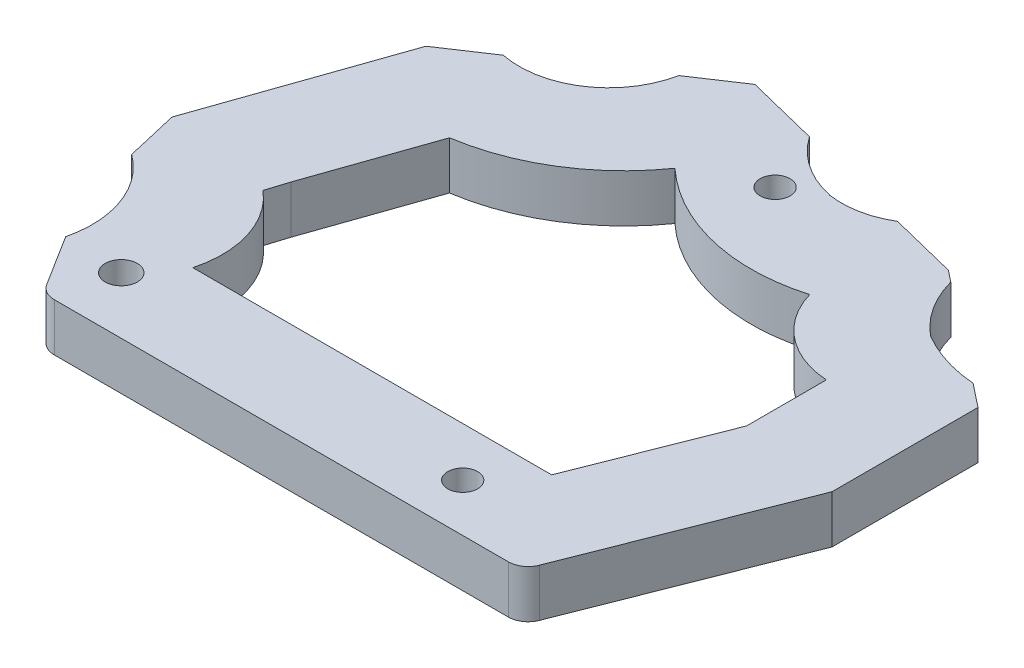
ISO-10303-21;
HEADER;
FILE_DESCRIPTION(('STEP AP214'),'2;1');
FILE_NAME('part.step','',(''),(''),'','','');
FILE_SCHEMA(('AUTOMOTIVE_DESIGN { 1 0 10303 214 1 1 1 1 }'));
ENDSEC;
DATA;
#1=APPLICATION_CONTEXT('core data for automotive mechanical design processes');
#2=APPLICATION_PROTOCOL_DEFINITION('international standard','automotive_design',2000,#1);
#3=PRODUCT_CONTEXT('',#1,'mechanical');
#4=PRODUCT('Part','Part','',(#3));
#5=PRODUCT_RELATED_PRODUCT_CATEGORY('part','',(#4));
#6=PRODUCT_DEFINITION_FORMATION('','',#4);
#7=PRODUCT_DEFINITION_CONTEXT('part definition',#1,'design');
#8=PRODUCT_DEFINITION('design','',#6,#7);
#9=PRODUCT_DEFINITION_SHAPE('','',#8);
#10=(LENGTH_UNIT() NAMED_UNIT(*) SI_UNIT(.MILLI.,.METRE.));
#11=(NAMED_UNIT(*) PLANE_ANGLE_UNIT() SI_UNIT($,.RADIAN.));
#12=(NAMED_UNIT(*) SI_UNIT($,.STERADIAN.) SOLID_ANGLE_UNIT());
#13=UNCERTAINTY_MEASURE_WITH_UNIT(LENGTH_MEASURE(1.E-05),#10,'distance_accuracy_value','');
#14=(GEOMETRIC_REPRESENTATION_CONTEXT(3) GLOBAL_UNCERTAINTY_ASSIGNED_CONTEXT((#13)) GLOBAL_UNIT_ASSIGNED_CONTEXT((#10,
#11,#12)) REPRESENTATION_CONTEXT('',''));
#15=CARTESIAN_POINT('',(0.,0.,0.));
#16=DIRECTION('',(0.,0.,1.));
#17=DIRECTION('',(1.,0.,0.));
#18=AXIS2_PLACEMENT_3D('',#15,#16,#17);
#19=CARTESIAN_POINT('',(41.5628843685812,4.8,16.3568056984194));
#20=DIRECTION('',(0.930533945831876,0.,0.366205646672138));
#21=DIRECTION('',(0.366205646672138,0.,-0.930533945831876));
#22=AXIS2_PLACEMENT_3D('',#19,#20,#21);
#23=PLANE('',#22);
#24=DIRECTION('',(-0.366205646672138,0.,0.930533945831876));
#25=VECTOR('',#24,1.);
#26=CARTESIAN_POINT('',(41.5628843685812,4.8,16.3568056984194));
#27=LINE('',#26,#25);
#28=CARTESIAN_POINT('',(56.7889355201313,4.8,-22.332814699965));
#29=VERTEX_POINT('',#28);
#30=CARTESIAN_POINT('',(48.4988513789469,4.8,-1.26758870665573));
#31=VERTEX_POINT('',#30);
#32=EDGE_CURVE('E301',#29,#31,#27,.T.);
#33=ORIENTED_EDGE('',*,*,#32,.T.);
#34=DIRECTION('',(0.,-1.,0.));
#35=VECTOR('',#34,1.);
#36=CARTESIAN_POINT('',(48.4988513789469,0.,-1.26758870665573));
#37=LINE('',#36,#35);
#38=CARTESIAN_POINT('',(48.4988513789469,0.,-1.26758870665573));
#39=VERTEX_POINT('',#38);
#40=EDGE_CURVE('E11',#31,#39,#37,.T.);
#41=ORIENTED_EDGE('',*,*,#40,.T.);
#42=DIRECTION('',(-0.366205646672138,0.,0.930533945831876));
#43=VECTOR('',#42,1.);
#44=CARTESIAN_POINT('',(41.5628843685812,0.,16.3568056984194));
#45=LINE('',#44,#43);
#46=CARTESIAN_POINT('',(56.7889355201313,0.,-22.332814699965));
#47=VERTEX_POINT('',#46);
#48=EDGE_CURVE('E400',#47,#39,#45,.T.);
#49=ORIENTED_EDGE('',*,*,#48,.F.);
#50=DIRECTION('',(0.,-1.,0.));
#51=VECTOR('',#50,1.);
#52=CARTESIAN_POINT('',(56.7889355201313,4.8,-22.332814699965));
#53=LINE('',#52,#51);
#54=EDGE_CURVE('E511',#29,#47,#53,.T.);
#55=ORIENTED_EDGE('',*,*,#54,.F.);
#56=EDGE_LOOP('',(#33,#41,#49,#55));
#57=FACE_BOUND('',#56,.T.);
#58=ADVANCED_FACE('F45',(#57),#23,.T.);
#59=CARTESIAN_POINT('',(56.7889355201313,4.8,0.));
#60=DIRECTION('',(1.,0.,0.));
#61=DIRECTION('',(0.,0.,-1.));
#62=AXIS2_PLACEMENT_3D('',#59,#60,#61);
#63=PLANE('',#62);
#64=DIRECTION('',(0.,0.,1.));
#65=VECTOR('',#64,1.);
#66=CARTESIAN_POINT('',(56.7889355201313,0.,0.));
#67=LINE('',#66,#65);
#68=CARTESIAN_POINT('',(56.7889355201313,0.,-36.95968206653));
#69=VERTEX_POINT('',#68);
#70=EDGE_CURVE('E404',#69,#47,#67,.T.);
#71=ORIENTED_EDGE('',*,*,#70,.F.);
#72=DIRECTION('',(0.,-1.,0.));
#73=VECTOR('',#72,1.);
#74=CARTESIAN_POINT('',(56.7889355201313,4.8,-36.95968206653));
#75=LINE('',#74,#73);
#76=CARTESIAN_POINT('',(56.7889355201313,4.8,-36.95968206653));
#77=VERTEX_POINT('',#76);
#78=EDGE_CURVE('E508',#77,#69,#75,.T.);
#79=ORIENTED_EDGE('',*,*,#78,.F.);
#80=DIRECTION('',(0.,0.,1.));
#81=VECTOR('',#80,1.);
#82=CARTESIAN_POINT('',(56.7889355201313,4.8,0.));
#83=LINE('',#82,#81);
#84=EDGE_CURVE('E304',#77,#29,#83,.T.);
#85=ORIENTED_EDGE('',*,*,#84,.T.);
#86=ORIENTED_EDGE('',*,*,#54,.T.);
#87=EDGE_LOOP('',(#71,#79,#85,#86));
#88=FACE_BOUND('',#87,.T.);
#89=ADVANCED_FACE('F586',(#88),#63,.T.);
#90=CARTESIAN_POINT('',(39.7983361955812,4.8,-50.3812847105911));
#91=DIRECTION('',(-0.619871067373993,0.,0.784703676449032));
#92=DIRECTION('',(0.784703676449032,0.,0.619871067373993));
#93=AXIS2_PLACEMENT_3D('',#90,#91,#92);
#94=PLANE('',#93);
#95=DIRECTION('',(-0.784703676449032,0.,-0.619871067373993));
#96=VECTOR('',#95,1.);
#97=CARTESIAN_POINT('',(39.7983361955812,0.,-50.3812847105911));
#98=LINE('',#97,#96);
#99=CARTESIAN_POINT('',(54.4348244907842,0.,-38.819295268652));
#100=VERTEX_POINT('',#99);
#101=EDGE_CURVE('E408',#69,#100,#98,.T.);
#102=ORIENTED_EDGE('',*,*,#101,.T.);
#103=DIRECTION('',(0.,-1.,0.));
#104=VECTOR('',#103,1.);
#105=CARTESIAN_POINT('',(54.4348244907842,4.8,-38.819295268652));
#106=LINE('',#105,#104);
#107=CARTESIAN_POINT('',(54.4348244907842,4.8,-38.819295268652));
#108=VERTEX_POINT('',#107);
#109=EDGE_CURVE('E505',#108,#100,#106,.T.);
#110=ORIENTED_EDGE('',*,*,#109,.F.);
#111=DIRECTION('',(-0.784703676449032,0.,-0.619871067373993));
#112=VECTOR('',#111,1.);
#113=CARTESIAN_POINT('',(39.7983361955812,4.8,-50.3812847105911));
#114=LINE('',#113,#112);
#115=EDGE_CURVE('E308',#77,#108,#114,.T.);
#116=ORIENTED_EDGE('',*,*,#115,.F.);
#117=ORIENTED_EDGE('',*,*,#78,.T.);
#118=EDGE_LOOP('',(#102,#110,#116,#117));
#119=FACE_BOUND('',#118,.T.);
#120=ADVANCED_FACE('F592',(#119),#94,.F.);
#121=CARTESIAN_POINT('',(55.5185057154235,4.8,-53.1336012109435));
#122=DIRECTION('',(0.,-1.,0.));
#123=DIRECTION('',(0.,0.,-1.));
#124=AXIS2_PLACEMENT_3D('',#121,#122,#123);
#125=CYLINDRICAL_SURFACE('',#124,14.3552680088585);
#126=CARTESIAN_POINT('',(55.5185057154235,0.,-53.1336012109435));
#127=DIRECTION('',(0.,1.,0.));
#128=DIRECTION('',(0.,0.,1.));
#129=AXIS2_PLACEMENT_3D('',#126,#127,#128);
#130=CIRCLE('',#129,14.3552680088585);
#131=CARTESIAN_POINT('',(48.2152560640326,0.,-40.7749498227209));
#132=VERTEX_POINT('',#131);
#133=EDGE_CURVE('E412',#132,#100,#130,.T.);
#134=ORIENTED_EDGE('',*,*,#133,.F.);
#135=DIRECTION('',(0.,-1.,0.));
#136=VECTOR('',#135,1.);
#137=CARTESIAN_POINT('',(48.2152560640326,4.8,-40.7749498227209));
#138=LINE('',#137,#136);
#139=CARTESIAN_POINT('',(48.2152560640326,4.8,-40.7749498227209));
#140=VERTEX_POINT('',#139);
#141=EDGE_CURVE('E502',#140,#132,#138,.T.);
#142=ORIENTED_EDGE('',*,*,#141,.F.);
#143=CARTESIAN_POINT('',(55.5185057154235,4.8,-53.1336012109435));
#144=DIRECTION('',(0.,1.,0.));
#145=DIRECTION('',(0.,0.,1.));
#146=AXIS2_PLACEMENT_3D('',#143,#144,#145);
#147=CIRCLE('',#146,14.3552680088585);
#148=EDGE_CURVE('E311',#140,#108,#147,.T.);
#149=ORIENTED_EDGE('',*,*,#148,.T.);
#150=ORIENTED_EDGE('',*,*,#109,.T.);
#151=EDGE_LOOP('',(#134,#142,#149,#150));
#152=FACE_BOUND('',#151,.T.);
#153=ADVANCED_FACE('F658',(#152),#125,.F.);
#154=CARTESIAN_POINT('',(55.2721485776059,4.8,-49.3668085057952));
#155=DIRECTION('',(0.,-1.,0.));
#156=DIRECTION('',(0.,0.,-1.));
#157=AXIS2_PLACEMENT_3D('',#154,#155,#156);
#158=CYLINDRICAL_SURFACE('',#157,11.1184426777335);
#159=CARTESIAN_POINT('',(55.2721485776059,0.,-49.3668085057952));
#160=DIRECTION('',(0.,1.,0.));
#161=DIRECTION('',(0.,0.,1.));
#162=AXIS2_PLACEMENT_3D('',#159,#160,#161);
#163=CIRCLE('',#162,11.1184426777335);
#164=CARTESIAN_POINT('',(44.5341657542064,0.,-46.4831489450247));
#165=VERTEX_POINT('',#164);
#166=EDGE_CURVE('E416',#165,#132,#163,.T.);
#167=ORIENTED_EDGE('',*,*,#166,.F.);
#168=DIRECTION('',(0.,-1.,0.));
#169=VECTOR('',#168,1.);
#170=CARTESIAN_POINT('',(44.5341657542064,4.8,-46.4831489450247));
#171=LINE('',#170,#169);
#172=CARTESIAN_POINT('',(44.5341657542064,4.8,-46.4831489450247));
#173=VERTEX_POINT('',#172);
#174=EDGE_CURVE('E499',#173,#165,#171,.T.);
#175=ORIENTED_EDGE('',*,*,#174,.F.);
#176=CARTESIAN_POINT('',(55.2721485776059,4.8,-49.3668085057952));
#177=DIRECTION('',(0.,1.,0.));
#178=DIRECTION('',(0.,0.,1.));
#179=AXIS2_PLACEMENT_3D('',#176,#177,#178);
#180=CIRCLE('',#179,11.1184426777335);
#181=EDGE_CURVE('E315',#173,#140,#180,.T.);
#182=ORIENTED_EDGE('',*,*,#181,.T.);
#183=ORIENTED_EDGE('',*,*,#141,.T.);
#184=EDGE_LOOP('',(#167,#175,#182,#183));
#185=FACE_BOUND('',#184,.T.);
#186=ADVANCED_FACE('F661',(#185),#158,.F.);
#187=CARTESIAN_POINT('',(39.8895295681035,4.8,-50.175626088264));
#188=DIRECTION('',(0.622304732207846,0.,-0.782775076424716));
#189=DIRECTION('',(-0.782775076424716,0.,-0.622304732207846));
#190=AXIS2_PLACEMENT_3D('',#187,#188,#189);
#191=PLANE('',#190);
#192=DIRECTION('',(0.782775076424716,0.,0.622304732207846));
#193=VECTOR('',#192,1.);
#194=CARTESIAN_POINT('',(39.8895295681035,0.,-50.175626088264));
#195=LINE('',#194,#193);
#196=CARTESIAN_POINT('',(43.3865769077676,0.,-47.3954799469642));
#197=VERTEX_POINT('',#196);
#198=EDGE_CURVE('E420',#197,#165,#195,.T.);
#199=ORIENTED_EDGE('',*,*,#198,.F.);
#200=DIRECTION('',(0.,-1.,0.));
#201=VECTOR('',#200,1.);
#202=CARTESIAN_POINT('',(43.3865769077676,4.8,-47.3954799469642));
#203=LINE('',#202,#201);
#204=CARTESIAN_POINT('',(43.3865769077676,4.8,-47.3954799469642));
#205=VERTEX_POINT('',#204);
#206=EDGE_CURVE('E496',#205,#197,#203,.T.);
#207=ORIENTED_EDGE('',*,*,#206,.F.);
#208=DIRECTION('',(0.782775076424716,0.,0.622304732207846));
#209=VECTOR('',#208,1.);
#210=CARTESIAN_POINT('',(39.8895295681035,4.8,-50.175626088264));
#211=LINE('',#210,#209);
#212=EDGE_CURVE('E319',#205,#173,#211,.T.);
#213=ORIENTED_EDGE('',*,*,#212,.T.);
#214=ORIENTED_EDGE('',*,*,#174,.T.);
#215=EDGE_LOOP('',(#199,#207,#213,#214));
#216=FACE_BOUND('',#215,.T.);
#217=ADVANCED_FACE('F666',(#216),#191,.T.);
#218=CARTESIAN_POINT('',(13.6469879297286,4.8,-54.8014164711111));
#219=DIRECTION('',(0.241646157516865,0.,-0.970364433889317));
#220=DIRECTION('',(-0.970364433889317,0.,-0.241646157516865));
#221=AXIS2_PLACEMENT_3D('',#218,#219,#220);
#222=PLANE('',#221);
#223=DIRECTION('',(0.970364433889317,0.,0.241646157516865));
#224=VECTOR('',#223,1.);
#225=CARTESIAN_POINT('',(13.6469879297286,0.,-54.8014164711111));
#226=LINE('',#225,#224);
#227=CARTESIAN_POINT('',(36.5940258705424,0.,-49.0870030495823));
#228=VERTEX_POINT('',#227);
#229=EDGE_CURVE('E424',#228,#197,#226,.T.);
#230=ORIENTED_EDGE('',*,*,#229,.F.);
#231=DIRECTION('',(0.,-1.,0.));
#232=VECTOR('',#231,1.);
#233=CARTESIAN_POINT('',(36.5940258705424,4.8,-49.0870030495823));
#234=LINE('',#233,#232);
#235=CARTESIAN_POINT('',(36.5940258705424,4.8,-49.0870030495823));
#236=VERTEX_POINT('',#235);
#237=EDGE_CURVE('E493',#236,#228,#234,.T.);
#238=ORIENTED_EDGE('',*,*,#237,.F.);
#239=DIRECTION('',(0.970364433889317,0.,0.241646157516865));
#240=VECTOR('',#239,1.);
#241=CARTESIAN_POINT('',(13.6469879297286,4.8,-54.8014164711111));
#242=LINE('',#241,#240);
#243=EDGE_CURVE('E323',#236,#205,#242,.T.);
#244=ORIENTED_EDGE('',*,*,#243,.T.);
#245=ORIENTED_EDGE('',*,*,#206,.T.);
#246=EDGE_LOOP('',(#230,#238,#244,#245));
#247=FACE_BOUND('',#246,.T.);
#248=ADVANCED_FACE('F669',(#247),#222,.T.);
#249=CARTESIAN_POINT('',(32.1763201205619,4.8,-56.4390751610626));
#250=DIRECTION('',(0.,-1.,0.));
#251=DIRECTION('',(0.,0.,-1.));
#252=AXIS2_PLACEMENT_3D('',#249,#250,#251);
#253=CYLINDRICAL_SURFACE('',#252,8.57724247213625);
#254=CARTESIAN_POINT('',(32.1763201205619,0.,-56.4390751610626));
#255=DIRECTION('',(0.,1.,0.));
#256=DIRECTION('',(0.,0.,1.));
#257=AXIS2_PLACEMENT_3D('',#254,#255,#256);
#258=CIRCLE('',#257,8.57724247213625);
#259=CARTESIAN_POINT('',(30.9370593029061,0.,-47.9518305521426));
#260=VERTEX_POINT('',#259);
#261=EDGE_CURVE('E428',#260,#228,#258,.T.);
#262=ORIENTED_EDGE('',*,*,#261,.F.);
#263=DIRECTION('',(0.,-1.,0.));
#264=VECTOR('',#263,1.);
#265=CARTESIAN_POINT('',(30.9370593029061,4.8,-47.9518305521426));
#266=LINE('',#265,#264);
#267=CARTESIAN_POINT('',(30.9370593029061,4.8,-47.9518305521426));
#268=VERTEX_POINT('',#267);
#269=EDGE_CURVE('E490',#268,#260,#266,.T.);
#270=ORIENTED_EDGE('',*,*,#269,.F.);
#271=CARTESIAN_POINT('',(32.1763201205619,4.8,-56.4390751610626));
#272=DIRECTION('',(0.,1.,0.));
#273=DIRECTION('',(0.,0.,1.));
#274=AXIS2_PLACEMENT_3D('',#271,#272,#273);
#275=CIRCLE('',#274,8.57724247213625);
#276=EDGE_CURVE('E327',#268,#236,#275,.T.);
#277=ORIENTED_EDGE('',*,*,#276,.T.);
#278=ORIENTED_EDGE('',*,*,#237,.T.);
#279=EDGE_LOOP('',(#262,#270,#277,#278));
#280=FACE_BOUND('',#279,.T.);
#281=ADVANCED_FACE('F674',(#280),#253,.F.);
#282=CARTESIAN_POINT('',(33.0360339215245,4.8,-57.7304421719374));
#283=DIRECTION('',(0.,-1.,0.));
#284=DIRECTION('',(0.,0.,-1.));
#285=AXIS2_PLACEMENT_3D('',#282,#283,#284);
#286=CYLINDRICAL_SURFACE('',#285,10.0013468923135);
#287=CARTESIAN_POINT('',(33.0360339215245,0.,-57.7304421719374));
#288=DIRECTION('',(0.,1.,0.));
#289=DIRECTION('',(0.,0.,1.));
#290=AXIS2_PLACEMENT_3D('',#287,#288,#289);
#291=CIRCLE('',#290,10.0013468923135);
#292=CARTESIAN_POINT('',(24.8242480090241,0.,-52.0213694111776));
#293=VERTEX_POINT('',#292);
#294=EDGE_CURVE('E432',#293,#260,#291,.T.);
#295=ORIENTED_EDGE('',*,*,#294,.F.);
#296=DIRECTION('',(0.,-1.,0.));
#297=VECTOR('',#296,1.);
#298=CARTESIAN_POINT('',(24.8242480090241,4.8,-52.0213694111776));
#299=LINE('',#298,#297);
#300=CARTESIAN_POINT('',(24.8242480090241,4.8,-52.0213694111776));
#301=VERTEX_POINT('',#300);
#302=EDGE_CURVE('E487',#301,#293,#299,.T.);
#303=ORIENTED_EDGE('',*,*,#302,.F.);
#304=CARTESIAN_POINT('',(33.0360339215245,4.8,-57.7304421719374));
#305=DIRECTION('',(0.,1.,0.));
#306=DIRECTION('',(0.,0.,1.));
#307=AXIS2_PLACEMENT_3D('',#304,#305,#306);
#308=CIRCLE('',#307,10.0013468923135);
#309=EDGE_CURVE('E331',#301,#268,#308,.T.);
#310=ORIENTED_EDGE('',*,*,#309,.T.);
#311=ORIENTED_EDGE('',*,*,#269,.T.);
#312=EDGE_LOOP('',(#295,#303,#310,#311));
#313=FACE_BOUND('',#312,.T.);
#314=ADVANCED_FACE('F677',(#313),#286,.F.);
#315=CARTESIAN_POINT('',(13.6225714911029,4.8,-54.8056731243943));
#316=DIRECTION('',(0.241221353033318,0.,-0.970470122590477));
#317=DIRECTION('',(-0.970470122590477,0.,-0.241221353033318));
#318=AXIS2_PLACEMENT_3D('',#315,#316,#317);
#319=PLANE('',#318);
#320=DIRECTION('',(0.970470122590477,0.,0.241221353033318));
#321=VECTOR('',#320,1.);
#322=CARTESIAN_POINT('',(13.6225714911029,0.,-54.8056731243943));
#323=LINE('',#322,#321);
#324=CARTESIAN_POINT('',(17.5457220895955,0.,-53.8305295589275));
#325=VERTEX_POINT('',#324);
#326=EDGE_CURVE('E436',#325,#293,#323,.T.);
#327=ORIENTED_EDGE('',*,*,#326,.F.);
#328=DIRECTION('',(0.,-1.,0.));
#329=VECTOR('',#328,1.);
#330=CARTESIAN_POINT('',(17.5457220895955,4.8,-53.8305295589275));
#331=LINE('',#330,#329);
#332=CARTESIAN_POINT('',(17.5457220895955,4.8,-53.8305295589275));
#333=VERTEX_POINT('',#332);
#334=EDGE_CURVE('E484',#333,#325,#331,.T.);
#335=ORIENTED_EDGE('',*,*,#334,.F.);
#336=DIRECTION('',(0.970470122590477,0.,0.241221353033318));
#337=VECTOR('',#336,1.);
#338=CARTESIAN_POINT('',(13.6225714911029,4.8,-54.8056731243943));
#339=LINE('',#338,#337);
#340=EDGE_CURVE('E335',#333,#301,#339,.T.);
#341=ORIENTED_EDGE('',*,*,#340,.T.);
#342=ORIENTED_EDGE('',*,*,#302,.T.);
#343=EDGE_LOOP('',(#327,#335,#341,#342));
#344=FACE_BOUND('',#343,.T.);
#345=ADVANCED_FACE('F682',(#344),#319,.T.);
#346=CARTESIAN_POINT('',(-19.4417297856656,4.8,-29.2242544566834));
#347=DIRECTION('',(-0.553889162599127,0.,-0.832590412841295));
#348=DIRECTION('',(-0.832590412841295,0.,0.553889162599127));
#349=AXIS2_PLACEMENT_3D('',#346,#347,#348);
#350=PLANE('',#349);
#351=DIRECTION('',(0.832590412841295,0.,-0.553889162599127));
#352=VECTOR('',#351,1.);
#353=CARTESIAN_POINT('',(-19.4417297856656,0.,-29.2242544566834));
#354=LINE('',#353,#352);
#355=CARTESIAN_POINT('',(12.9664748189684,0.,-50.7841391646323));
#356=VERTEX_POINT('',#355);
#357=EDGE_CURVE('E440',#356,#325,#354,.T.);
#358=ORIENTED_EDGE('',*,*,#357,.F.);
#359=DIRECTION('',(0.,-1.,0.));
#360=VECTOR('',#359,1.);
#361=CARTESIAN_POINT('',(12.9664748189684,4.8,-50.7841391646323));
#362=LINE('',#361,#360);
#363=CARTESIAN_POINT('',(12.9664748189684,4.8,-50.7841391646323));
#364=VERTEX_POINT('',#363);
#365=EDGE_CURVE('E481',#364,#356,#362,.T.);
#366=ORIENTED_EDGE('',*,*,#365,.F.);
#367=DIRECTION('',(0.832590412841295,0.,-0.553889162599127));
#368=VECTOR('',#367,1.);
#369=CARTESIAN_POINT('',(-19.4417297856656,4.8,-29.2242544566834));
#370=LINE('',#369,#368);
#371=EDGE_CURVE('E339',#364,#333,#370,.T.);
#372=ORIENTED_EDGE('',*,*,#371,.T.);
#373=ORIENTED_EDGE('',*,*,#334,.T.);
#374=EDGE_LOOP('',(#358,#366,#372,#373));
#375=FACE_BOUND('',#374,.T.);
#376=ADVANCED_FACE('F685',(#375),#350,.T.);
#377=CARTESIAN_POINT('',(4.15724956369393,4.8,-52.5549132429522));
#378=DIRECTION('',(0.,-1.,0.));
#379=DIRECTION('',(0.,0.,-1.));
#380=AXIS2_PLACEMENT_3D('',#377,#378,#379);
#381=CYLINDRICAL_SURFACE('',#380,8.98543768742598);
#382=CARTESIAN_POINT('',(4.15724956369393,0.,-52.5549132429522));
#383=DIRECTION('',(0.,1.,0.));
#384=DIRECTION('',(0.,0.,1.));
#385=AXIS2_PLACEMENT_3D('',#382,#383,#384);
#386=CIRCLE('',#385,8.98543768742598);
#387=CARTESIAN_POINT('',(2.38647548537404,0.,-43.7456879876777));
#388=VERTEX_POINT('',#387);
#389=EDGE_CURVE('E444',#388,#356,#386,.T.);
#390=ORIENTED_EDGE('',*,*,#389,.F.);
#391=DIRECTION('',(0.,-1.,0.));
#392=VECTOR('',#391,1.);
#393=CARTESIAN_POINT('',(2.38647548537404,4.8,-43.7456879876777));
#394=LINE('',#393,#392);
#395=CARTESIAN_POINT('',(2.38647548537404,4.8,-43.7456879876777));
#396=VERTEX_POINT('',#395);
#397=EDGE_CURVE('E478',#396,#388,#394,.T.);
#398=ORIENTED_EDGE('',*,*,#397,.F.);
#399=CARTESIAN_POINT('',(4.15724956369393,4.8,-52.5549132429522));
#400=DIRECTION('',(0.,1.,0.));
#401=DIRECTION('',(0.,0.,1.));
#402=AXIS2_PLACEMENT_3D('',#399,#400,#401);
#403=CIRCLE('',#402,8.98543768742598);
#404=EDGE_CURVE('E343',#396,#364,#403,.T.);
#405=ORIENTED_EDGE('',*,*,#404,.T.);
#406=ORIENTED_EDGE('',*,*,#365,.T.);
#407=EDGE_LOOP('',(#390,#398,#405,#406));
#408=FACE_BOUND('',#407,.T.);
#409=ADVANCED_FACE('F690',(#408),#381,.F.);
#410=CARTESIAN_POINT('',(-19.4417297856656,4.8,-29.2242544566835));
#411=DIRECTION('',(-0.553889162599127,0.,-0.832590412841295));
#412=DIRECTION('',(-0.832590412841295,0.,0.553889162599127));
#413=AXIS2_PLACEMENT_3D('',#410,#411,#412);
#414=PLANE('',#413);
#415=DIRECTION('',(0.832590412841295,0.,-0.553889162599127));
#416=VECTOR('',#415,1.);
#417=CARTESIAN_POINT('',(-19.4417297856656,0.,-29.2242544566835));
#418=LINE('',#417,#416);
#419=CARTESIAN_POINT('',(-2.26896358760709,0.,-40.6486102290412));
#420=VERTEX_POINT('',#419);
#421=EDGE_CURVE('E448',#420,#388,#418,.T.);
#422=ORIENTED_EDGE('',*,*,#421,.F.);
#423=DIRECTION('',(0.,-1.,0.));
#424=VECTOR('',#423,1.);
#425=CARTESIAN_POINT('',(-2.26896358760709,4.8,-40.6486102290412));
#426=LINE('',#425,#424);
#427=CARTESIAN_POINT('',(-2.26896358760709,4.8,-40.6486102290412));
#428=VERTEX_POINT('',#427);
#429=EDGE_CURVE('E475',#428,#420,#426,.T.);
#430=ORIENTED_EDGE('',*,*,#429,.F.);
#431=DIRECTION('',(0.832590412841295,0.,-0.553889162599127));
#432=VECTOR('',#431,1.);
#433=CARTESIAN_POINT('',(-19.4417297856656,4.8,-29.2242544566835));
#434=LINE('',#433,#432);
#435=EDGE_CURVE('E347',#428,#396,#434,.T.);
#436=ORIENTED_EDGE('',*,*,#435,.T.);
#437=ORIENTED_EDGE('',*,*,#397,.T.);
#438=EDGE_LOOP('',(#422,#430,#436,#437));
#439=FACE_BOUND('',#438,.T.);
#440=ADVANCED_FACE('F693',(#439),#414,.T.);
#441=CARTESIAN_POINT('',(-14.6547739977784,4.8,-5.10700817821361));
#442=DIRECTION('',(-0.944302782754934,0.,-0.329077885129475));
#443=DIRECTION('',(-0.329077885129475,0.,0.944302782754934));
#444=AXIS2_PLACEMENT_3D('',#441,#442,#443);
#445=PLANE('',#444);
#446=DIRECTION('',(0.329077885129475,0.,-0.944302782754934));
#447=VECTOR('',#446,1.);
#448=CARTESIAN_POINT('',(-14.6547739977784,0.,-5.10700817821361));
#449=LINE('',#448,#447);
#450=CARTESIAN_POINT('',(-8.85052129019658,0.,-21.7625545739426));
#451=VERTEX_POINT('',#450);
#452=EDGE_CURVE('E452',#451,#420,#449,.T.);
#453=ORIENTED_EDGE('',*,*,#452,.F.);
#454=DIRECTION('',(0.,-1.,0.));
#455=VECTOR('',#454,1.);
#456=CARTESIAN_POINT('',(-8.85052129019658,4.8,-21.7625545739426));
#457=LINE('',#456,#455);
#458=CARTESIAN_POINT('',(-8.85052129019658,4.8,-21.7625545739426));
#459=VERTEX_POINT('',#458);
#460=EDGE_CURVE('E472',#459,#451,#457,.T.);
#461=ORIENTED_EDGE('',*,*,#460,.F.);
#462=DIRECTION('',(0.329077885129475,0.,-0.944302782754934));
#463=VECTOR('',#462,1.);
#464=CARTESIAN_POINT('',(-14.6547739977784,4.8,-5.10700817821361));
#465=LINE('',#464,#463);
#466=EDGE_CURVE('E351',#459,#428,#465,.T.);
#467=ORIENTED_EDGE('',*,*,#466,.T.);
#468=ORIENTED_EDGE('',*,*,#429,.T.);
#469=EDGE_LOOP('',(#453,#461,#467,#468));
#470=FACE_BOUND('',#469,.T.);
#471=ADVANCED_FACE('F698',(#470),#445,.T.);
#472=CARTESIAN_POINT('',(-3.5988377596126,4.8,0.836322825140343));
#473=DIRECTION('',(-0.974044809038178,0.,0.22635527381923));
#474=DIRECTION('',(0.22635527381923,0.,0.974044809038178));
#475=AXIS2_PLACEMENT_3D('',#472,#473,#474);
#476=PLANE('',#475);
#477=DIRECTION('',(-0.22635527381923,0.,-0.974044809038178));
#478=VECTOR('',#477,1.);
#479=CARTESIAN_POINT('',(-3.5988377596126,0.,0.836322825140343));
#480=LINE('',#479,#478);
#481=CARTESIAN_POINT('',(-7.62617773562171,0.,-16.4939983627654));
#482=VERTEX_POINT('',#481);
#483=EDGE_CURVE('E456',#482,#451,#480,.T.);
#484=ORIENTED_EDGE('',*,*,#483,.F.);
#485=DIRECTION('',(0.,-1.,0.));
#486=VECTOR('',#485,1.);
#487=CARTESIAN_POINT('',(-7.62617773562171,4.8,-16.4939983627654));
#488=LINE('',#487,#486);
#489=CARTESIAN_POINT('',(-7.62617773562171,4.8,-16.4939983627654));
#490=VERTEX_POINT('',#489);
#491=EDGE_CURVE('E469',#490,#482,#488,.T.);
#492=ORIENTED_EDGE('',*,*,#491,.F.);
#493=DIRECTION('',(-0.22635527381923,0.,-0.974044809038178));
#494=VECTOR('',#493,1.);
#495=CARTESIAN_POINT('',(-3.5988377596126,4.8,0.836322825140343));
#496=LINE('',#495,#494);
#497=EDGE_CURVE('E355',#490,#459,#496,.T.);
#498=ORIENTED_EDGE('',*,*,#497,.T.);
#499=ORIENTED_EDGE('',*,*,#460,.T.);
#500=EDGE_LOOP('',(#484,#492,#498,#499));
#501=FACE_BOUND('',#500,.T.);
#502=ADVANCED_FACE('F701',(#501),#476,.T.);
#503=CARTESIAN_POINT('',(-13.5055004524711,4.8,-8.40489678155517));
#504=DIRECTION('',(0.,-1.,0.));
#505=DIRECTION('',(0.,0.,-1.));
#506=AXIS2_PLACEMENT_3D('',#503,#504,#505);
#507=CYLINDRICAL_SURFACE('',#506,10.);
#508=CARTESIAN_POINT('',(-13.5055004524711,0.,-8.40489678155517));
#509=DIRECTION('',(0.,1.,0.));
#510=DIRECTION('',(0.,0.,1.));
#511=AXIS2_PLACEMENT_3D('',#508,#509,#510);
#512=CIRCLE('',#511,10.);
#513=CARTESIAN_POINT('',(-3.7889505914019,0.,-6.04086234920111));
#514=VERTEX_POINT('',#513);
#515=EDGE_CURVE('E460',#482,#514,#512,.F.);
#516=ORIENTED_EDGE('',*,*,#515,.T.);
#517=DIRECTION('',(0.,-1.,0.));
#518=VECTOR('',#517,1.);
#519=CARTESIAN_POINT('',(-3.7889505914019,4.8,-6.04086234920111));
#520=LINE('',#519,#518);
#521=CARTESIAN_POINT('',(-3.7889505914019,4.8,-6.04086234920111));
#522=VERTEX_POINT('',#521);
#523=EDGE_CURVE('E253',#522,#514,#520,.T.);
#524=ORIENTED_EDGE('',*,*,#523,.F.);
#525=CARTESIAN_POINT('',(-13.5055004524711,4.8,-8.40489678155517));
#526=DIRECTION('',(0.,1.,0.));
#527=DIRECTION('',(0.,0.,1.));
#528=AXIS2_PLACEMENT_3D('',#525,#526,#527);
#529=CIRCLE('',#528,10.);
#530=EDGE_CURVE('E359',#490,#522,#529,.F.);
#531=ORIENTED_EDGE('',*,*,#530,.F.);
#532=ORIENTED_EDGE('',*,*,#491,.T.);
#533=EDGE_LOOP('',(#516,#524,#531,#532));
#534=FACE_BOUND('',#533,.T.);
#535=ADVANCED_FACE('F705',(#534),#507,.F.);
#536=CARTESIAN_POINT('',(0.,4.8,0.));
#537=DIRECTION('',(0.847151919965807,0.,-0.531350754679287));
#538=DIRECTION('',(-0.531350754679287,0.,-0.847151919965807));
#539=AXIS2_PLACEMENT_3D('',#536,#537,#538);
#540=PLANE('',#539);
#541=DIRECTION('',(0.531350754679287,0.,0.847151919965807));
#542=VECTOR('',#541,1.);
#543=CARTESIAN_POINT('',(0.,0.,0.));
#544=LINE('',#543,#542);
#545=CARTESIAN_POINT('',(-0.587892500299333,0.,-0.937298490641426));
#546=VERTEX_POINT('',#545);
#547=EDGE_CURVE('E274',#514,#546,#544,.T.);
#548=ORIENTED_EDGE('',*,*,#547,.T.);
#549=DIRECTION('',(0.,-1.,0.));
#550=VECTOR('',#549,1.);
#551=CARTESIAN_POINT('',(-0.587892500299333,4.8,-0.937298490641426));
#552=LINE('',#551,#550);
#553=CARTESIAN_POINT('',(-0.587892500299333,4.8,-0.937298490641426));
#554=VERTEX_POINT('',#553);
#555=EDGE_CURVE('E71',#546,#554,#552,.F.);
#556=ORIENTED_EDGE('',*,*,#555,.T.);
#557=DIRECTION('',(0.531350754679287,0.,0.847151919965807));
#558=VECTOR('',#557,1.);
#559=CARTESIAN_POINT('',(0.,4.8,0.));
#560=LINE('',#559,#558);
#561=EDGE_CURVE('E363',#522,#554,#560,.T.);
#562=ORIENTED_EDGE('',*,*,#561,.F.);
#563=ORIENTED_EDGE('',*,*,#523,.T.);
#564=EDGE_LOOP('',(#548,#556,#562,#563));
#565=FACE_BOUND('',#564,.T.);
#566=ADVANCED_FACE('F629',(#565),#540,.F.);
#567=CARTESIAN_POINT('',(-4.40669973797978,4.8,-1.53568056417699));
#568=DIRECTION('',(0.944302782754934,0.,0.329077885129475));
#569=DIRECTION('',(0.329077885129475,0.,-0.944302782754934));
#570=AXIS2_PLACEMENT_3D('',#567,#568,#569);
#571=PLANE('',#570);
#572=DIRECTION('',(-0.329077885129475,0.,0.944302782754934));
#573=VECTOR('',#572,1.);
#574=CARTESIAN_POINT('',(-4.40669973797978,0.,-1.53568056417699));
#575=LINE('',#574,#573);
#576=CARTESIAN_POINT('',(6.86466789665755,0.,-33.8793423652556));
#577=VERTEX_POINT('',#576);
#578=CARTESIAN_POINT('',(2.75119433253912,0.,-22.075557580819));
#579=VERTEX_POINT('',#578);
#580=EDGE_CURVE('E249',#577,#579,#575,.T.);
#581=ORIENTED_EDGE('',*,*,#580,.F.);
#582=DIRECTION('',(0.,-1.,0.));
#583=VECTOR('',#582,1.);
#584=CARTESIAN_POINT('',(6.86466789665755,4.8,-33.8793423652556));
#585=LINE('',#584,#583);
#586=CARTESIAN_POINT('',(6.86466789665755,4.8,-33.8793423652556));
#587=VERTEX_POINT('',#586);
#588=EDGE_CURVE('E242',#587,#577,#585,.T.);
#589=ORIENTED_EDGE('',*,*,#588,.F.);
#590=DIRECTION('',(-0.329077885129475,0.,0.944302782754934));
#591=VECTOR('',#590,1.);
#592=CARTESIAN_POINT('',(-4.40669973797978,4.8,-1.53568056417699));
#593=LINE('',#592,#591);
#594=CARTESIAN_POINT('',(2.75119433253912,4.8,-22.075557580819));
#595=VERTEX_POINT('',#594);
#596=EDGE_CURVE('E246',#587,#595,#593,.T.);
#597=ORIENTED_EDGE('',*,*,#596,.T.);
#598=DIRECTION('',(0.,-1.,0.));
#599=VECTOR('',#598,1.);
#600=CARTESIAN_POINT('',(2.75119433253912,4.8,-22.075557580819));
#601=LINE('',#600,#599);
#602=EDGE_CURVE('E369',#595,#579,#601,.T.);
#603=ORIENTED_EDGE('',*,*,#602,.T.);
#604=EDGE_LOOP('',(#581,#589,#597,#603));
#605=FACE_BOUND('',#604,.T.);
#606=ADVANCED_FACE('F244',(#605),#571,.T.);
#607=CARTESIAN_POINT('',(3.68573134636542,4.8,-54.5783973477388));
#608=DIRECTION('',(0.,-1.,0.));
#609=DIRECTION('',(0.,0.,-1.));
#610=AXIS2_PLACEMENT_3D('',#607,#608,#609);
#611=CYLINDRICAL_SURFACE('',#610,20.9417409677095);
#612=CARTESIAN_POINT('',(3.68573134636542,0.,-54.5783973477388));
#613=DIRECTION('',(0.,1.,0.));
#614=DIRECTION('',(0.,0.,1.));
#615=AXIS2_PLACEMENT_3D('',#612,#613,#614);
#616=CIRCLE('',#615,20.9417409677095);
#617=CARTESIAN_POINT('',(20.8175586455308,0.,-42.5344358669711));
#618=VERTEX_POINT('',#617);
#619=EDGE_CURVE('E372',#577,#618,#616,.T.);
#620=ORIENTED_EDGE('',*,*,#619,.T.);
#621=DIRECTION('',(0.,-1.,0.));
#622=VECTOR('',#621,1.);
#623=CARTESIAN_POINT('',(20.8175586455308,4.8,-42.5344358669711));
#624=LINE('',#623,#622);
#625=CARTESIAN_POINT('',(20.8175586455308,4.8,-42.5344358669711));
#626=VERTEX_POINT('',#625);
#627=EDGE_CURVE('E254',#626,#618,#624,.T.);
#628=ORIENTED_EDGE('',*,*,#627,.F.);
#629=CARTESIAN_POINT('',(3.68573134636542,4.8,-54.5783973477388));
#630=DIRECTION('',(0.,1.,0.));
#631=DIRECTION('',(0.,0.,1.));
#632=AXIS2_PLACEMENT_3D('',#629,#630,#631);
#633=CIRCLE('',#632,20.9417409677095);
#634=EDGE_CURVE('E257',#587,#626,#633,.T.);
#635=ORIENTED_EDGE('',*,*,#634,.F.);
#636=ORIENTED_EDGE('',*,*,#588,.T.);
#637=EDGE_LOOP('',(#620,#628,#635,#636));
#638=FACE_BOUND('',#637,.T.);
#639=ADVANCED_FACE('F258',(#638),#611,.T.);
#640=CARTESIAN_POINT('',(33.4045007873495,4.8,-56.1052930182402));
#641=DIRECTION('',(0.,-1.,0.));
#642=DIRECTION('',(0.,0.,-1.));
#643=AXIS2_PLACEMENT_3D('',#640,#641,#642);
#644=CYLINDRICAL_SURFACE('',#643,18.5094374928479);
#645=CARTESIAN_POINT('',(33.4045007873495,0.,-56.1052930182402));
#646=DIRECTION('',(0.,1.,0.));
#647=DIRECTION('',(0.,0.,1.));
#648=AXIS2_PLACEMENT_3D('',#645,#646,#647);
#649=CIRCLE('',#648,18.5094374928479);
#650=CARTESIAN_POINT('',(38.5440830536452,0.,-38.3237303639171));
#651=VERTEX_POINT('',#650);
#652=EDGE_CURVE('E375',#618,#651,#649,.T.);
#653=ORIENTED_EDGE('',*,*,#652,.T.);
#654=DIRECTION('',(0.,-1.,0.));
#655=VECTOR('',#654,1.);
#656=CARTESIAN_POINT('',(38.5440830536452,4.8,-38.3237303639171));
#657=LINE('',#656,#655);
#658=CARTESIAN_POINT('',(38.5440830536452,4.8,-38.3237303639171));
#659=VERTEX_POINT('',#658);
#660=EDGE_CURVE('E534',#659,#651,#657,.T.);
#661=ORIENTED_EDGE('',*,*,#660,.F.);
#662=CARTESIAN_POINT('',(33.4045007873495,4.8,-56.1052930182402));
#663=DIRECTION('',(0.,1.,0.));
#664=DIRECTION('',(0.,0.,1.));
#665=AXIS2_PLACEMENT_3D('',#662,#663,#664);
#666=CIRCLE('',#665,18.5094374928479);
#667=EDGE_CURVE('E263',#626,#659,#666,.T.);
#668=ORIENTED_EDGE('',*,*,#667,.F.);
#669=ORIENTED_EDGE('',*,*,#627,.T.);
#670=EDGE_LOOP('',(#653,#661,#668,#669));
#671=FACE_BOUND('',#670,.T.);
#672=ADVANCED_FACE('F621',(#671),#644,.T.);
#673=CARTESIAN_POINT('',(47.3283079034668,4.8,-40.8875133412536));
#674=DIRECTION('',(0.,-1.,0.));
#675=DIRECTION('',(0.,0.,-1.));
#676=AXIS2_PLACEMENT_3D('',#673,#674,#675);
#677=CYLINDRICAL_SURFACE('',#676,9.15071523800748);
#678=CARTESIAN_POINT('',(47.3283079034668,0.,-40.8875133412536));
#679=DIRECTION('',(0.,1.,0.));
#680=DIRECTION('',(0.,0.,1.));
#681=AXIS2_PLACEMENT_3D('',#678,#679,#680);
#682=CIRCLE('',#681,9.15071523800748);
#683=CARTESIAN_POINT('',(46.7889355201313,0.,-31.7527080998049));
#684=VERTEX_POINT('',#683);
#685=EDGE_CURVE('E378',#651,#684,#682,.T.);
#686=ORIENTED_EDGE('',*,*,#685,.T.);
#687=DIRECTION('',(0.,-1.,0.));
#688=VECTOR('',#687,1.);
#689=CARTESIAN_POINT('',(46.7889355201313,4.8,-31.7527080998049));
#690=LINE('',#689,#688);
#691=CARTESIAN_POINT('',(46.7889355201313,4.8,-31.7527080998049));
#692=VERTEX_POINT('',#691);
#693=EDGE_CURVE('E530',#692,#684,#690,.T.);
#694=ORIENTED_EDGE('',*,*,#693,.F.);
#695=CARTESIAN_POINT('',(47.3283079034668,4.8,-40.8875133412536));
#696=DIRECTION('',(0.,1.,0.));
#697=DIRECTION('',(0.,0.,1.));
#698=AXIS2_PLACEMENT_3D('',#695,#696,#697);
#699=CIRCLE('',#698,9.15071523800748);
#700=EDGE_CURVE('E282',#659,#692,#699,.T.);
#701=ORIENTED_EDGE('',*,*,#700,.F.);
#702=ORIENTED_EDGE('',*,*,#660,.T.);
#703=EDGE_LOOP('',(#686,#694,#701,#702));
#704=FACE_BOUND('',#703,.T.);
#705=ADVANCED_FACE('F617',(#704),#677,.T.);
#706=CARTESIAN_POINT('',(46.7889355201313,4.8,0.));
#707=DIRECTION('',(1.,0.,0.));
#708=DIRECTION('',(0.,0.,-1.));
#709=AXIS2_PLACEMENT_3D('',#706,#707,#708);
#710=PLANE('',#709);
#711=DIRECTION('',(0.,0.,1.));
#712=VECTOR('',#711,1.);
#713=CARTESIAN_POINT('',(46.7889355201313,0.,0.));
#714=LINE('',#713,#712);
#715=CARTESIAN_POINT('',(46.7889355201313,0.,-23.7527080998049));
#716=VERTEX_POINT('',#715);
#717=EDGE_CURVE('E381',#684,#716,#714,.T.);
#718=ORIENTED_EDGE('',*,*,#717,.T.);
#719=DIRECTION('',(0.,-1.,0.));
#720=VECTOR('',#719,1.);
#721=CARTESIAN_POINT('',(46.7889355201313,4.8,-23.7527080998049));
#722=LINE('',#721,#720);
#723=CARTESIAN_POINT('',(46.7889355201313,4.8,-23.7527080998049));
#724=VERTEX_POINT('',#723);
#725=EDGE_CURVE('E526',#724,#716,#722,.T.);
#726=ORIENTED_EDGE('',*,*,#725,.F.);
#727=DIRECTION('',(0.,0.,1.));
#728=VECTOR('',#727,1.);
#729=CARTESIAN_POINT('',(46.7889355201313,4.8,0.));
#730=LINE('',#729,#728);
#731=EDGE_CURVE('E285',#692,#724,#730,.T.);
#732=ORIENTED_EDGE('',*,*,#731,.F.);
#733=ORIENTED_EDGE('',*,*,#693,.T.);
#734=EDGE_LOOP('',(#718,#726,#732,#733));
#735=FACE_BOUND('',#734,.T.);
#736=ADVANCED_FACE('F613',(#735),#710,.F.);
#737=CARTESIAN_POINT('',(32.4200976156757,4.8,12.758720802935));
#738=DIRECTION('',(0.930533945831876,0.,0.366205646672138));
#739=DIRECTION('',(0.366205646672138,0.,-0.930533945831876));
#740=AXIS2_PLACEMENT_3D('',#737,#738,#739);
#741=PLANE('',#740);
#742=DIRECTION('',(-0.366205646672138,0.,0.930533945831876));
#743=VECTOR('',#742,1.);
#744=CARTESIAN_POINT('',(32.4200976156757,0.,12.758720802935));
#745=LINE('',#744,#743);
#746=CARTESIAN_POINT('',(41.2688117901432,0.,-9.72599233879738));
#747=VERTEX_POINT('',#746);
#748=EDGE_CURVE('E384',#716,#747,#745,.T.);
#749=ORIENTED_EDGE('',*,*,#748,.T.);
#750=DIRECTION('',(0.,-1.,0.));
#751=VECTOR('',#750,1.);
#752=CARTESIAN_POINT('',(41.2688117901432,4.8,-9.72599233879738));
#753=LINE('',#752,#751);
#754=CARTESIAN_POINT('',(41.2688117901432,4.8,-9.72599233879738));
#755=VERTEX_POINT('',#754);
#756=EDGE_CURVE('E523',#755,#747,#753,.T.);
#757=ORIENTED_EDGE('',*,*,#756,.F.);
#758=DIRECTION('',(-0.366205646672138,0.,0.930533945831876));
#759=VECTOR('',#758,1.);
#760=CARTESIAN_POINT('',(32.4200976156757,4.8,12.758720802935));
#761=LINE('',#760,#759);
#762=EDGE_CURVE('E288',#724,#755,#761,.T.);
#763=ORIENTED_EDGE('',*,*,#762,.F.);
#764=ORIENTED_EDGE('',*,*,#725,.T.);
#765=EDGE_LOOP('',(#749,#757,#763,#764));
#766=FACE_BOUND('',#765,.T.);
#767=ADVANCED_FACE('F609',(#766),#741,.F.);
#768=CARTESIAN_POINT('',(0.,4.8,-9.72599233879738));
#769=DIRECTION('',(0.,0.,-1.));
#770=DIRECTION('',(-1.,0.,0.));
#771=AXIS2_PLACEMENT_3D('',#768,#769,#770);
#772=PLANE('',#771);
#773=DIRECTION('',(1.,0.,0.));
#774=VECTOR('',#773,1.);
#775=CARTESIAN_POINT('',(0.,0.,-9.72599233879738));
#776=LINE('',#775,#774);
#777=CARTESIAN_POINT('',(5.26881179014316,0.,-9.72599233879738));
#778=VERTEX_POINT('',#777);
#779=EDGE_CURVE('E388',#778,#747,#776,.T.);
#780=ORIENTED_EDGE('',*,*,#779,.F.);
#781=DIRECTION('',(0.,-1.,0.));
#782=VECTOR('',#781,1.);
#783=CARTESIAN_POINT('',(5.26881179014316,4.8,-9.72599233879738));
#784=LINE('',#783,#782);
#785=CARTESIAN_POINT('',(5.26881179014316,4.8,-9.72599233879738));
#786=VERTEX_POINT('',#785);
#787=EDGE_CURVE('E520',#786,#778,#784,.T.);
#788=ORIENTED_EDGE('',*,*,#787,.F.);
#789=DIRECTION('',(1.,0.,0.));
#790=VECTOR('',#789,1.);
#791=CARTESIAN_POINT('',(0.,4.8,-9.72599233879738));
#792=LINE('',#791,#790);
#793=EDGE_CURVE('E291',#786,#755,#792,.T.);
#794=ORIENTED_EDGE('',*,*,#793,.T.);
#795=ORIENTED_EDGE('',*,*,#756,.T.);
#796=EDGE_LOOP('',(#780,#788,#794,#795));
#797=FACE_BOUND('',#796,.T.);
#798=ADVANCED_FACE('F605',(#797),#772,.T.);
#799=CARTESIAN_POINT('',(-4.29912157763426,4.8,-12.3565495023521));
#800=DIRECTION('',(0.,-1.,0.));
#801=DIRECTION('',(0.,0.,-1.));
#802=AXIS2_PLACEMENT_3D('',#799,#800,#801);
#803=CYLINDRICAL_SURFACE('',#802,9.92296225534278);
#804=CARTESIAN_POINT('',(-4.29912157763426,0.,-12.3565495023521));
#805=DIRECTION('',(0.,1.,0.));
#806=DIRECTION('',(0.,0.,1.));
#807=AXIS2_PLACEMENT_3D('',#804,#805,#806);
#808=CIRCLE('',#807,9.92296225534278);
#809=CARTESIAN_POINT('',(2.08568761055648,0.,-19.9525610578563));
#810=VERTEX_POINT('',#809);
#811=EDGE_CURVE('E392',#810,#778,#808,.F.);
#812=ORIENTED_EDGE('',*,*,#811,.F.);
#813=DIRECTION('',(0.,-1.,0.));
#814=VECTOR('',#813,1.);
#815=CARTESIAN_POINT('',(2.08568761055648,4.8,-19.9525610578563));
#816=LINE('',#815,#814);
#817=CARTESIAN_POINT('',(2.08568761055648,4.8,-19.9525610578563));
#818=VERTEX_POINT('',#817);
#819=EDGE_CURVE('E517',#818,#810,#816,.T.);
#820=ORIENTED_EDGE('',*,*,#819,.F.);
#821=CARTESIAN_POINT('',(-4.29912157763426,4.8,-12.3565495023521));
#822=DIRECTION('',(0.,1.,0.));
#823=DIRECTION('',(0.,0.,1.));
#824=AXIS2_PLACEMENT_3D('',#821,#822,#823);
#825=CIRCLE('',#824,9.92296225534278);
#826=EDGE_CURVE('E295',#818,#786,#825,.F.);
#827=ORIENTED_EDGE('',*,*,#826,.T.);
#828=ORIENTED_EDGE('',*,*,#787,.T.);
#829=EDGE_LOOP('',(#812,#820,#827,#828));
#830=FACE_BOUND('',#829,.T.);
#831=ADVANCED_FACE('F601',(#830),#803,.T.);
#832=CARTESIAN_POINT('',(-3.79593148190113,4.8,-1.18993031315253));
#833=DIRECTION('',(0.954214681068071,0.,0.29912262106728));
#834=DIRECTION('',(0.29912262106728,0.,-0.954214681068071));
#835=AXIS2_PLACEMENT_3D('',#832,#833,#834);
#836=PLANE('',#835);
#837=DIRECTION('',(-0.29912262106728,0.,0.954214681068071));
#838=VECTOR('',#837,1.);
#839=CARTESIAN_POINT('',(-3.79593148190113,0.,-1.18993031315253));
#840=LINE('',#839,#838);
#841=EDGE_CURVE('E396',#579,#810,#840,.T.);
#842=ORIENTED_EDGE('',*,*,#841,.F.);
#843=ORIENTED_EDGE('',*,*,#602,.F.);
#844=DIRECTION('',(-0.29912262106728,0.,0.954214681068071));
#845=VECTOR('',#844,1.);
#846=CARTESIAN_POINT('',(-3.79593148190113,4.8,-1.18993031315253));
#847=LINE('',#846,#845);
#848=EDGE_CURVE('E268',#595,#818,#847,.T.);
#849=ORIENTED_EDGE('',*,*,#848,.T.);
#850=ORIENTED_EDGE('',*,*,#819,.T.);
#851=EDGE_LOOP('',(#842,#843,#849,#850));
#852=FACE_BOUND('',#851,.T.);
#853=ADVANCED_FACE('F597',(#852),#836,.T.);
#854=CARTESIAN_POINT('',(0.,4.8,0.));
#855=DIRECTION('',(0.,0.,-1.));
#856=DIRECTION('',(-1.,0.,0.));
#857=AXIS2_PLACEMENT_3D('',#854,#855,#856);
#858=PLANE('',#857);
#859=DIRECTION('',(1.,0.,0.));
#860=VECTOR('',#859,1.);
#861=CARTESIAN_POINT('',(0.,4.8,0.));
#862=LINE('',#861,#860);
#863=CARTESIAN_POINT('',(1.10641133963228,4.8,0.));
#864=VERTEX_POINT('',#863);
#865=CARTESIAN_POINT('',(46.6377834872832,4.8,0.));
#866=VERTEX_POINT('',#865);
#867=EDGE_CURVE('E366',#864,#866,#862,.T.);
#868=ORIENTED_EDGE('',*,*,#867,.F.);
#869=DIRECTION('',(0.,-1.,0.));
#870=VECTOR('',#869,1.);
#871=CARTESIAN_POINT('',(1.10641133963228,4.8,0.));
#872=LINE('',#871,#870);
#873=CARTESIAN_POINT('',(1.10641133963228,0.,0.));
#874=VERTEX_POINT('',#873);
#875=EDGE_CURVE('E542',#864,#874,#872,.T.);
#876=ORIENTED_EDGE('',*,*,#875,.T.);
#877=DIRECTION('',(1.,0.,0.));
#878=VECTOR('',#877,1.);
#879=CARTESIAN_POINT('',(0.,0.,0.));
#880=LINE('',#879,#878);
#881=CARTESIAN_POINT('',(46.6377834872832,0.,0.));
#882=VERTEX_POINT('',#881);
#883=EDGE_CURVE('E270',#874,#882,#880,.T.);
#884=ORIENTED_EDGE('',*,*,#883,.T.);
#885=DIRECTION('',(0.,-1.,0.));
#886=VECTOR('',#885,1.);
#887=CARTESIAN_POINT('',(46.6377834872832,4.8,0.));
#888=LINE('',#887,#886);
#889=EDGE_CURVE('E514',#882,#866,#888,.F.);
#890=ORIENTED_EDGE('',*,*,#889,.T.);
#891=EDGE_LOOP('',(#868,#876,#884,#890));
#892=FACE_BOUND('',#891,.T.);
#893=ADVANCED_FACE('F600',(#892),#858,.F.);
#894=CARTESIAN_POINT('',(0.,4.8,0.));
#895=DIRECTION('',(0.,1.,0.));
#896=DIRECTION('',(0.,0.,1.));
#897=AXIS2_PLACEMENT_3D('',#894,#895,#896);
#898=PLANE('',#897);
#899=CARTESIAN_POINT('',(27.4936308043001,4.8,-45.9052570480755));
#900=DIRECTION('',(0.,1.,0.));
#901=DIRECTION('',(0.,0.,1.));
#902=AXIS2_PLACEMENT_3D('',#899,#900,#901);
#903=CIRCLE('',#902,1.5);
#904=CARTESIAN_POINT('',(27.4936308043001,4.8,-44.4052570480755));
#905=VERTEX_POINT('',#904);
#906=EDGE_CURVE('E562',#905,#905,#903,.T.);
#907=ORIENTED_EDGE('',*,*,#906,.F.);
#908=EDGE_LOOP('',(#907));
#909=FACE_BOUND('',#908,.T.);
#910=CARTESIAN_POINT('',(37.2688117901432,4.8,-4.8));
#911=DIRECTION('',(0.,1.,0.));
#912=DIRECTION('',(0.,0.,1.));
#913=AXIS2_PLACEMENT_3D('',#910,#911,#912);
#914=CIRCLE('',#913,1.5);
#915=CARTESIAN_POINT('',(37.2688117901432,4.8,-3.3));
#916=VERTEX_POINT('',#915);
#917=EDGE_CURVE('E1033',#916,#916,#914,.T.);
#918=ORIENTED_EDGE('',*,*,#917,.F.);
#919=EDGE_LOOP('',(#918));
#920=FACE_BOUND('',#919,.T.);
#921=CARTESIAN_POINT('',(2.12484514254045,4.8,-5.7));
#922=DIRECTION('',(0.,1.,0.));
#923=DIRECTION('',(0.,0.,1.));
#924=AXIS2_PLACEMENT_3D('',#921,#922,#923);
#925=CIRCLE('',#924,1.61474667431014);
#926=CARTESIAN_POINT('',(2.12484514254045,4.8,-4.08525332568986));
#927=VERTEX_POINT('',#926);
#928=EDGE_CURVE('E277',#927,#927,#925,.T.);
#929=ORIENTED_EDGE('',*,*,#928,.F.);
#930=EDGE_LOOP('',(#929));
#931=FACE_BOUND('',#930,.T.);
#932=ORIENTED_EDGE('',*,*,#596,.F.);
#933=ORIENTED_EDGE('',*,*,#634,.T.);
#934=ORIENTED_EDGE('',*,*,#667,.T.);
#935=ORIENTED_EDGE('',*,*,#700,.T.);
#936=ORIENTED_EDGE('',*,*,#731,.T.);
#937=ORIENTED_EDGE('',*,*,#762,.T.);
#938=ORIENTED_EDGE('',*,*,#793,.F.);
#939=ORIENTED_EDGE('',*,*,#826,.F.);
#940=ORIENTED_EDGE('',*,*,#848,.F.);
#941=EDGE_LOOP('',(#932,#933,#934,#935,#936,#937,#938,#939,#940));
#942=FACE_BOUND('',#941,.T.);
#943=ORIENTED_EDGE('',*,*,#561,.T.);
#944=CARTESIAN_POINT('',(1.10641133963228,4.8,-2.));
#945=DIRECTION('',(0.,1.,0.));
#946=DIRECTION('',(0.,0.,1.));
#947=AXIS2_PLACEMENT_3D('',#944,#945,#946);
#948=CIRCLE('',#947,2.);
#949=EDGE_CURVE('E55',#554,#864,#948,.T.);
#950=ORIENTED_EDGE('',*,*,#949,.T.);
#951=ORIENTED_EDGE('',*,*,#867,.T.);
#952=CARTESIAN_POINT('',(46.6377834872832,4.8,-2.));
#953=DIRECTION('',(0.,1.,0.));
#954=DIRECTION('',(0.,0.,1.));
#955=AXIS2_PLACEMENT_3D('',#952,#953,#954);
#956=CIRCLE('',#955,2.);
#957=EDGE_CURVE('E63',#866,#31,#956,.T.);
#958=ORIENTED_EDGE('',*,*,#957,.T.);
#959=ORIENTED_EDGE('',*,*,#32,.F.);
#960=ORIENTED_EDGE('',*,*,#84,.F.);
#961=ORIENTED_EDGE('',*,*,#115,.T.);
#962=ORIENTED_EDGE('',*,*,#148,.F.);
#963=ORIENTED_EDGE('',*,*,#181,.F.);
#964=ORIENTED_EDGE('',*,*,#212,.F.);
#965=ORIENTED_EDGE('',*,*,#243,.F.);
#966=ORIENTED_EDGE('',*,*,#276,.F.);
#967=ORIENTED_EDGE('',*,*,#309,.F.);
#968=ORIENTED_EDGE('',*,*,#340,.F.);
#969=ORIENTED_EDGE('',*,*,#371,.F.);
#970=ORIENTED_EDGE('',*,*,#404,.F.);
#971=ORIENTED_EDGE('',*,*,#435,.F.);
#972=ORIENTED_EDGE('',*,*,#466,.F.);
#973=ORIENTED_EDGE('',*,*,#497,.F.);
#974=ORIENTED_EDGE('',*,*,#530,.T.);
#975=EDGE_LOOP('',(#943,#950,#951,#958,#959,#960,#961,#962,#963,#964,#965,#966,#967,#968,#969,
#970,#971,#972,#973,#974));
#976=FACE_BOUND('',#975,.T.);
#977=ADVANCED_FACE('F265',(#909,#920,#931,#942,#976),#898,.T.);
#978=CARTESIAN_POINT('',(0.,0.,0.));
#979=DIRECTION('',(0.,1.,0.));
#980=DIRECTION('',(0.,0.,1.));
#981=AXIS2_PLACEMENT_3D('',#978,#979,#980);
#982=PLANE('',#981);
#983=CARTESIAN_POINT('',(27.4936308043001,0.,-45.9052570480755));
#984=DIRECTION('',(0.,1.,0.));
#985=DIRECTION('',(0.,0.,1.));
#986=AXIS2_PLACEMENT_3D('',#983,#984,#985);
#987=CIRCLE('',#986,1.5);
#988=CARTESIAN_POINT('',(27.4936308043001,0.,-44.4052570480755));
#989=VERTEX_POINT('',#988);
#990=EDGE_CURVE('E49',#989,#989,#987,.T.);
#991=ORIENTED_EDGE('',*,*,#990,.T.);
#992=EDGE_LOOP('',(#991));
#993=FACE_BOUND('',#992,.T.);
#994=CARTESIAN_POINT('',(37.2688117901432,0.,-4.8));
#995=DIRECTION('',(0.,1.,0.));
#996=DIRECTION('',(0.,0.,1.));
#997=AXIS2_PLACEMENT_3D('',#994,#995,#996);
#998=CIRCLE('',#997,1.5);
#999=CARTESIAN_POINT('',(37.2688117901432,0.,-3.3));
#1000=VERTEX_POINT('',#999);
#1001=EDGE_CURVE('E561',#1000,#1000,#998,.T.);
#1002=ORIENTED_EDGE('',*,*,#1001,.T.);
#1003=EDGE_LOOP('',(#1002));
#1004=FACE_BOUND('',#1003,.T.);
#1005=CARTESIAN_POINT('',(2.12484514254045,0.,-5.7));
#1006=DIRECTION('',(0.,1.,0.));
#1007=DIRECTION('',(0.,0.,1.));
#1008=AXIS2_PLACEMENT_3D('',#1005,#1006,#1007);
#1009=CIRCLE('',#1008,1.61474667431014);
#1010=CARTESIAN_POINT('',(2.12484514254045,0.,-4.08525332568986));
#1011=VERTEX_POINT('',#1010);
#1012=EDGE_CURVE('E558',#1011,#1011,#1009,.T.);
#1013=ORIENTED_EDGE('',*,*,#1012,.T.);
#1014=EDGE_LOOP('',(#1013));
#1015=FACE_BOUND('',#1014,.T.);
#1016=ORIENTED_EDGE('',*,*,#580,.T.);
#1017=ORIENTED_EDGE('',*,*,#841,.T.);
#1018=ORIENTED_EDGE('',*,*,#811,.T.);
#1019=ORIENTED_EDGE('',*,*,#779,.T.);
#1020=ORIENTED_EDGE('',*,*,#748,.F.);
#1021=ORIENTED_EDGE('',*,*,#717,.F.);
#1022=ORIENTED_EDGE('',*,*,#685,.F.);
#1023=ORIENTED_EDGE('',*,*,#652,.F.);
#1024=ORIENTED_EDGE('',*,*,#619,.F.);
#1025=EDGE_LOOP('',(#1016,#1017,#1018,#1019,#1020,#1021,#1022,#1023,#1024));
#1026=FACE_BOUND('',#1025,.T.);
#1027=ORIENTED_EDGE('',*,*,#883,.F.);
#1028=CARTESIAN_POINT('',(1.10641133963228,0.,-2.));
#1029=DIRECTION('',(0.,1.,0.));
#1030=DIRECTION('',(0.,0.,1.));
#1031=AXIS2_PLACEMENT_3D('',#1028,#1029,#1030);
#1032=CIRCLE('',#1031,2.);
#1033=EDGE_CURVE('E549',#874,#546,#1032,.F.);
#1034=ORIENTED_EDGE('',*,*,#1033,.T.);
#1035=ORIENTED_EDGE('',*,*,#547,.F.);
#1036=ORIENTED_EDGE('',*,*,#515,.F.);
#1037=ORIENTED_EDGE('',*,*,#483,.T.);
#1038=ORIENTED_EDGE('',*,*,#452,.T.);
#1039=ORIENTED_EDGE('',*,*,#421,.T.);
#1040=ORIENTED_EDGE('',*,*,#389,.T.);
#1041=ORIENTED_EDGE('',*,*,#357,.T.);
#1042=ORIENTED_EDGE('',*,*,#326,.T.);
#1043=ORIENTED_EDGE('',*,*,#294,.T.);
#1044=ORIENTED_EDGE('',*,*,#261,.T.);
#1045=ORIENTED_EDGE('',*,*,#229,.T.);
#1046=ORIENTED_EDGE('',*,*,#198,.T.);
#1047=ORIENTED_EDGE('',*,*,#166,.T.);
#1048=ORIENTED_EDGE('',*,*,#133,.T.);
#1049=ORIENTED_EDGE('',*,*,#101,.F.);
#1050=ORIENTED_EDGE('',*,*,#70,.T.);
#1051=ORIENTED_EDGE('',*,*,#48,.T.);
#1052=CARTESIAN_POINT('',(46.6377834872832,0.,-2.));
#1053=DIRECTION('',(0.,1.,0.));
#1054=DIRECTION('',(0.,0.,1.));
#1055=AXIS2_PLACEMENT_3D('',#1052,#1053,#1054);
#1056=CIRCLE('',#1055,2.);
#1057=EDGE_CURVE('E546',#39,#882,#1056,.F.);
#1058=ORIENTED_EDGE('',*,*,#1057,.T.);
#1059=EDGE_LOOP('',(#1027,#1034,#1035,#1036,#1037,#1038,#1039,#1040,#1041,#1042,#1043,#1044,
#1045,#1046,#1047,#1048,#1049,#1050,#1051,#1058));
#1060=FACE_BOUND('',#1059,.T.);
#1061=ADVANCED_FACE('F571',(#993,#1004,#1015,#1026,#1060),#982,.F.);
#1062=CARTESIAN_POINT('',(1.10641133963228,4.8,-2.));
#1063=DIRECTION('',(0.,-1.,0.));
#1064=DIRECTION('',(0.,0.,-1.));
#1065=AXIS2_PLACEMENT_3D('',#1062,#1063,#1064);
#1066=CYLINDRICAL_SURFACE('',#1065,2.);
#1067=ORIENTED_EDGE('',*,*,#949,.F.);
#1068=ORIENTED_EDGE('',*,*,#555,.F.);
#1069=ORIENTED_EDGE('',*,*,#1033,.F.);
#1070=ORIENTED_EDGE('',*,*,#875,.F.);
#1071=EDGE_LOOP('',(#1067,#1068,#1069,#1070));
#1072=FACE_BOUND('',#1071,.T.);
#1073=ADVANCED_FACE('F630',(#1072),#1066,.T.);
#1074=CARTESIAN_POINT('',(46.6377834872832,4.8,-2.));
#1075=DIRECTION('',(0.,1.,0.));
#1076=DIRECTION('',(0.,0.,1.));
#1077=AXIS2_PLACEMENT_3D('',#1074,#1075,#1076);
#1078=CYLINDRICAL_SURFACE('',#1077,2.);
#1079=ORIENTED_EDGE('',*,*,#957,.F.);
#1080=ORIENTED_EDGE('',*,*,#889,.F.);
#1081=ORIENTED_EDGE('',*,*,#1057,.F.);
#1082=ORIENTED_EDGE('',*,*,#40,.F.);
#1083=EDGE_LOOP('',(#1079,#1080,#1081,#1082));
#1084=FACE_BOUND('',#1083,.T.);
#1085=ADVANCED_FACE('F47',(#1084),#1078,.T.);
#1086=CARTESIAN_POINT('',(2.12484514254045,-5.2,-5.7));
#1087=DIRECTION('',(0.,1.,0.));
#1088=DIRECTION('',(0.,0.,1.));
#1089=AXIS2_PLACEMENT_3D('',#1086,#1087,#1088);
#1090=CYLINDRICAL_SURFACE('',#1089,1.61474667431014);
#1091=ORIENTED_EDGE('',*,*,#928,.T.);
#1092=EDGE_LOOP('',(#1091));
#1093=FACE_BOUND('',#1092,.T.);
#1094=ORIENTED_EDGE('',*,*,#1012,.F.);
#1095=EDGE_LOOP('',(#1094));
#1096=FACE_BOUND('',#1095,.T.);
#1097=ADVANCED_FACE('F581',(#1093,#1096),#1090,.F.);
#1098=CARTESIAN_POINT('',(37.2688117901432,-5.2,-4.8));
#1099=DIRECTION('',(0.,1.,0.));
#1100=DIRECTION('',(0.,0.,1.));
#1101=AXIS2_PLACEMENT_3D('',#1098,#1099,#1100);
#1102=CYLINDRICAL_SURFACE('',#1101,1.5);
#1103=ORIENTED_EDGE('',*,*,#917,.T.);
#1104=EDGE_LOOP('',(#1103));
#1105=FACE_BOUND('',#1104,.T.);
#1106=ORIENTED_EDGE('',*,*,#1001,.F.);
#1107=EDGE_LOOP('',(#1106));
#1108=FACE_BOUND('',#1107,.T.);
#1109=ADVANCED_FACE('F575',(#1105,#1108),#1102,.F.);
#1110=CARTESIAN_POINT('',(27.4936308043001,-5.2,-45.9052570480755));
#1111=DIRECTION('',(0.,1.,0.));
#1112=DIRECTION('',(0.,0.,1.));
#1113=AXIS2_PLACEMENT_3D('',#1110,#1111,#1112);
#1114=CYLINDRICAL_SURFACE('',#1113,1.5);
#1115=ORIENTED_EDGE('',*,*,#906,.T.);
#1116=EDGE_LOOP('',(#1115));
#1117=FACE_BOUND('',#1116,.T.);
#1118=ORIENTED_EDGE('',*,*,#990,.F.);
#1119=EDGE_LOOP('',(#1118));
#1120=FACE_BOUND('',#1119,.T.);
#1121=ADVANCED_FACE('F573',(#1117,#1120),#1114,.F.);
#1122=CLOSED_SHELL('',(#58,#89,#120,#153,#186,#217,#248,#281,#314,#345,#376,#409,#440,#471,#502,
#535,#566,#606,#639,#672,#705,#736,#767,#798,#831,#853,#893,#977,#1061,#1073,#1085,#1097,#1109,#1121));
#1123=MANIFOLD_SOLID_BREP('B2',#1122);
#1124=ADVANCED_BREP_SHAPE_REPRESENTATION('',(#18,#1123),#14);
#1125=SHAPE_DEFINITION_REPRESENTATION(#9,#1124);
ENDSEC;
END-ISO-10303-21;
